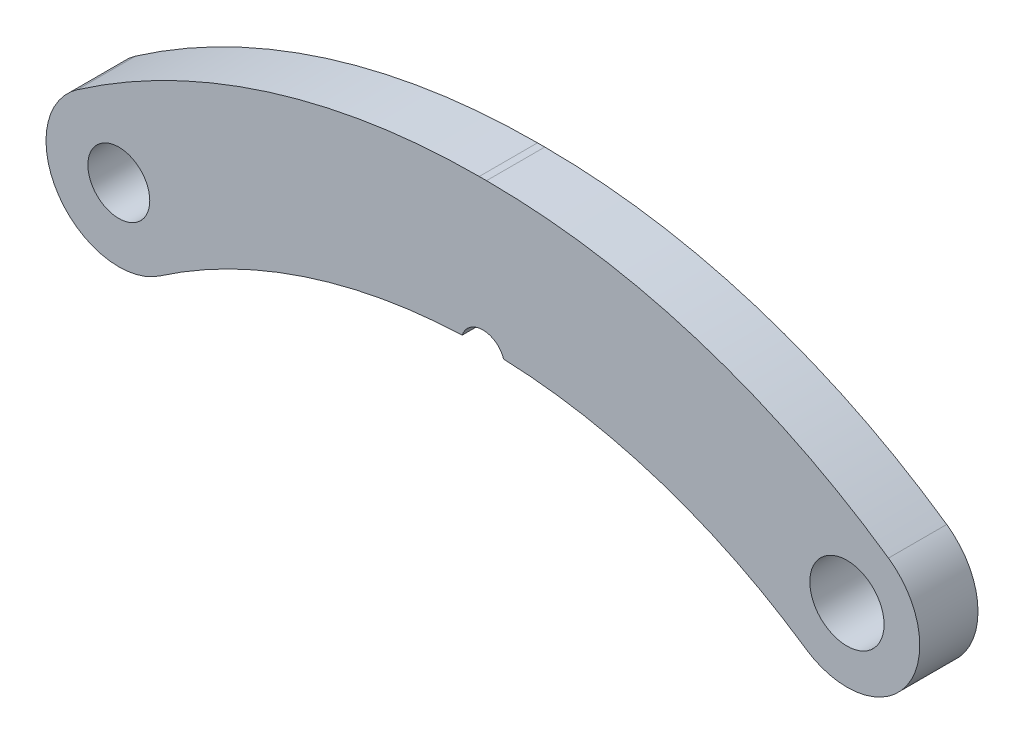
ISO-10303-21;
HEADER;
FILE_DESCRIPTION(('STEP AP214'),'2;1');
FILE_NAME('part.step','',(''),(''),'','','');
FILE_SCHEMA(('AUTOMOTIVE_DESIGN { 1 0 10303 214 1 1 1 1 }'));
ENDSEC;
DATA;
#1=APPLICATION_CONTEXT('core data for automotive mechanical design processes');
#2=APPLICATION_PROTOCOL_DEFINITION('international standard','automotive_design',2000,#1);
#3=PRODUCT_CONTEXT('',#1,'mechanical');
#4=PRODUCT('Part','Part','',(#3));
#5=PRODUCT_RELATED_PRODUCT_CATEGORY('part','',(#4));
#6=PRODUCT_DEFINITION_FORMATION('','',#4);
#7=PRODUCT_DEFINITION_CONTEXT('part definition',#1,'design');
#8=PRODUCT_DEFINITION('design','',#6,#7);
#9=PRODUCT_DEFINITION_SHAPE('','',#8);
#10=(LENGTH_UNIT() NAMED_UNIT(*) SI_UNIT(.MILLI.,.METRE.));
#11=(NAMED_UNIT(*) PLANE_ANGLE_UNIT() SI_UNIT($,.RADIAN.));
#12=(NAMED_UNIT(*) SI_UNIT($,.STERADIAN.) SOLID_ANGLE_UNIT());
#13=UNCERTAINTY_MEASURE_WITH_UNIT(LENGTH_MEASURE(1.E-05),#10,'distance_accuracy_value','');
#14=(GEOMETRIC_REPRESENTATION_CONTEXT(3) GLOBAL_UNCERTAINTY_ASSIGNED_CONTEXT((#13)) GLOBAL_UNIT_ASSIGNED_CONTEXT((#10,
#11,#12)) REPRESENTATION_CONTEXT('',''));
#15=CARTESIAN_POINT('',(0.,0.,0.));
#16=DIRECTION('',(0.,0.,1.));
#17=DIRECTION('',(1.,0.,0.));
#18=AXIS2_PLACEMENT_3D('',#15,#16,#17);
#19=CARTESIAN_POINT('',(-50.,-72.8951612903225,10.));
#20=DIRECTION('',(0.,0.,-1.));
#21=DIRECTION('',(-1.,0.,0.));
#22=AXIS2_PLACEMENT_3D('',#19,#20,#21);
#23=CYLINDRICAL_SURFACE('',#22,78.3951612903225);
#24=DIRECTION('',(0.,0.,-1.));
#25=VECTOR('',#24,1.);
#26=CARTESIAN_POINT('',(-47.1538280934798,5.44831718245282,4.));
#27=LINE('',#26,#25);
#28=CARTESIAN_POINT('',(-47.1538280934798,5.44831718245284,0.));
#29=VERTEX_POINT('',#28);
#30=CARTESIAN_POINT('',(-47.1538280934798,5.44831718245284,8.));
#31=VERTEX_POINT('',#30);
#32=EDGE_CURVE('E12',#29,#31,#27,.F.);
#33=ORIENTED_EDGE('',*,*,#32,.F.);
#34=CARTESIAN_POINT('',(-50.,-72.8951612903225,0.));
#35=DIRECTION('',(0.,0.,-1.));
#36=DIRECTION('',(-1.,0.,0.));
#37=AXIS2_PLACEMENT_3D('',#34,#35,#36);
#38=CIRCLE('',#37,78.3951612903225);
#39=CARTESIAN_POINT('',(-5.65641821001735,-8.24651035489463,0.));
#40=VERTEX_POINT('',#39);
#41=EDGE_CURVE('E117',#40,#29,#38,.F.);
#42=ORIENTED_EDGE('',*,*,#41,.F.);
#43=DIRECTION('',(0.,0.,-1.));
#44=VECTOR('',#43,1.);
#45=CARTESIAN_POINT('',(-5.65641821001735,-8.24651035489463,10.));
#46=LINE('',#45,#44);
#47=CARTESIAN_POINT('',(-5.65641821001735,-8.24651035489463,8.));
#48=VERTEX_POINT('',#47);
#49=EDGE_CURVE('E124',#48,#40,#46,.T.);
#50=ORIENTED_EDGE('',*,*,#49,.F.);
#51=CARTESIAN_POINT('',(-50.,-72.8951612903225,8.));
#52=DIRECTION('',(0.,0.,1.));
#53=DIRECTION('',(1.,0.,0.));
#54=AXIS2_PLACEMENT_3D('',#51,#52,#53);
#55=CIRCLE('',#54,78.3951612903225);
#56=EDGE_CURVE('E128',#31,#48,#55,.F.);
#57=ORIENTED_EDGE('',*,*,#56,.F.);
#58=EDGE_LOOP('',(#33,#42,#50,#57));
#59=FACE_BOUND('',#58,.T.);
#60=ADVANCED_FACE('F39',(#59),#23,.F.);
#61=CARTESIAN_POINT('',(0.,0.,8.));
#62=DIRECTION('',(0.,0.,1.));
#63=DIRECTION('',(1.,0.,0.));
#64=AXIS2_PLACEMENT_3D('',#61,#62,#63);
#65=PLANE('',#64);
#66=CARTESIAN_POINT('',(-50.,4.5,8.));
#67=DIRECTION('',(0.,0.,-1.));
#68=DIRECTION('',(-1.,0.,0.));
#69=AXIS2_PLACEMENT_3D('',#66,#67,#68);
#70=CIRCLE('',#69,3.);
#71=CARTESIAN_POINT('',(-52.8461719065202,5.44831718245284,8.));
#72=VERTEX_POINT('',#71);
#73=EDGE_CURVE('E53',#72,#31,#70,.T.);
#74=ORIENTED_EDGE('',*,*,#73,.T.);
#75=ORIENTED_EDGE('',*,*,#56,.T.);
#76=CARTESIAN_POINT('',(0.,0.,8.));
#77=DIRECTION('',(0.,0.,-1.));
#78=DIRECTION('',(-1.,0.,0.));
#79=AXIS2_PLACEMENT_3D('',#76,#77,#78);
#80=CIRCLE('',#79,10.);
#81=CARTESIAN_POINT('',(5.70340085485969,8.21408660100354,8.));
#82=VERTEX_POINT('',#81);
#83=EDGE_CURVE('E163',#82,#48,#80,.T.);
#84=ORIENTED_EDGE('',*,*,#83,.F.);
#85=CARTESIAN_POINT('',(-49.5,-71.2903225806452,8.));
#86=DIRECTION('',(0.,0.,-1.));
#87=DIRECTION('',(-1.,0.,0.));
#88=AXIS2_PLACEMENT_3D('',#85,#86,#87);
#89=CIRCLE('',#88,96.7903225806452);
#90=CARTESIAN_POINT('',(-49.5,25.5,8.));
#91=VERTEX_POINT('',#90);
#92=EDGE_CURVE('E140',#82,#91,#89,.F.);
#93=ORIENTED_EDGE('',*,*,#92,.T.);
#94=DIRECTION('',(1.,0.,0.));
#95=VECTOR('',#94,1.);
#96=CARTESIAN_POINT('',(-49.5,25.5,8.));
#97=LINE('',#96,#95);
#98=CARTESIAN_POINT('',(-50.5,25.5,8.));
#99=VERTEX_POINT('',#98);
#100=EDGE_CURVE('E146',#99,#91,#97,.T.);
#101=ORIENTED_EDGE('',*,*,#100,.F.);
#102=CARTESIAN_POINT('',(-50.5,-71.2903225806452,8.));
#103=DIRECTION('',(0.,0.,-1.));
#104=DIRECTION('',(-1.,0.,0.));
#105=AXIS2_PLACEMENT_3D('',#102,#103,#104);
#106=CIRCLE('',#105,96.7903225806452);
#107=CARTESIAN_POINT('',(-105.70340085486,8.21408660100354,8.));
#108=VERTEX_POINT('',#107);
#109=EDGE_CURVE('E134',#99,#108,#106,.F.);
#110=ORIENTED_EDGE('',*,*,#109,.T.);
#111=CARTESIAN_POINT('',(-100.,0.,8.));
#112=DIRECTION('',(0.,0.,-1.));
#113=DIRECTION('',(-1.,0.,0.));
#114=AXIS2_PLACEMENT_3D('',#111,#112,#113);
#115=CIRCLE('',#114,10.);
#116=CARTESIAN_POINT('',(-94.3435817899827,-8.24651035489463,8.));
#117=VERTEX_POINT('',#116);
#118=EDGE_CURVE('E159',#117,#108,#115,.T.);
#119=ORIENTED_EDGE('',*,*,#118,.F.);
#120=EDGE_CURVE('E131',#117,#72,#55,.F.);
#121=ORIENTED_EDGE('',*,*,#120,.T.);
#122=EDGE_LOOP('',(#74,#75,#84,#93,#101,#110,#119,#121));
#123=FACE_BOUND('',#122,.T.);
#124=CARTESIAN_POINT('',(-100.,0.,8.));
#125=DIRECTION('',(0.,0.,1.));
#126=DIRECTION('',(1.,0.,0.));
#127=AXIS2_PLACEMENT_3D('',#124,#125,#126);
#128=CIRCLE('',#127,4.25000000000001);
#129=CARTESIAN_POINT('',(-95.75,0.,8.));
#130=VERTEX_POINT('',#129);
#131=EDGE_CURVE('E172',#130,#130,#128,.T.);
#132=ORIENTED_EDGE('',*,*,#131,.F.);
#133=EDGE_LOOP('',(#132));
#134=FACE_BOUND('',#133,.T.);
#135=CARTESIAN_POINT('',(0.,0.,8.));
#136=DIRECTION('',(0.,0.,1.));
#137=DIRECTION('',(1.,0.,0.));
#138=AXIS2_PLACEMENT_3D('',#135,#136,#137);
#139=CIRCLE('',#138,5.1);
#140=CARTESIAN_POINT('',(5.1,0.,8.));
#141=VERTEX_POINT('',#140);
#142=EDGE_CURVE('E109',#141,#141,#139,.T.);
#143=ORIENTED_EDGE('',*,*,#142,.F.);
#144=EDGE_LOOP('',(#143));
#145=FACE_BOUND('',#144,.T.);
#146=ADVANCED_FACE('F201',(#123,#134,#145),#65,.T.);
#147=CARTESIAN_POINT('',(0.,0.,0.));
#148=DIRECTION('',(0.,0.,1.));
#149=DIRECTION('',(1.,0.,0.));
#150=AXIS2_PLACEMENT_3D('',#147,#148,#149);
#151=PLANE('',#150);
#152=CARTESIAN_POINT('',(0.,0.,0.));
#153=DIRECTION('',(0.,0.,1.));
#154=DIRECTION('',(1.,0.,0.));
#155=AXIS2_PLACEMENT_3D('',#152,#153,#154);
#156=CIRCLE('',#155,5.1);
#157=CARTESIAN_POINT('',(5.1,0.,0.));
#158=VERTEX_POINT('',#157);
#159=EDGE_CURVE('E175',#158,#158,#156,.T.);
#160=ORIENTED_EDGE('',*,*,#159,.T.);
#161=EDGE_LOOP('',(#160));
#162=FACE_BOUND('',#161,.T.);
#163=CARTESIAN_POINT('',(-100.,0.,0.));
#164=DIRECTION('',(0.,0.,1.));
#165=DIRECTION('',(1.,0.,0.));
#166=AXIS2_PLACEMENT_3D('',#163,#164,#165);
#167=CIRCLE('',#166,4.25000000000001);
#168=CARTESIAN_POINT('',(-95.75,0.,0.));
#169=VERTEX_POINT('',#168);
#170=EDGE_CURVE('E168',#169,#169,#167,.T.);
#171=ORIENTED_EDGE('',*,*,#170,.T.);
#172=EDGE_LOOP('',(#171));
#173=FACE_BOUND('',#172,.T.);
#174=ORIENTED_EDGE('',*,*,#41,.T.);
#175=CARTESIAN_POINT('',(-50.,4.5,0.));
#176=DIRECTION('',(0.,0.,-1.));
#177=DIRECTION('',(-1.,0.,0.));
#178=AXIS2_PLACEMENT_3D('',#175,#176,#177);
#179=CIRCLE('',#178,3.);
#180=CARTESIAN_POINT('',(-52.8461719065202,5.44831718245284,0.));
#181=VERTEX_POINT('',#180);
#182=EDGE_CURVE('E103',#181,#29,#179,.T.);
#183=ORIENTED_EDGE('',*,*,#182,.F.);
#184=CARTESIAN_POINT('',(-94.3435817899827,-8.24651035489463,0.));
#185=VERTEX_POINT('',#184);
#186=EDGE_CURVE('E114',#181,#185,#38,.F.);
#187=ORIENTED_EDGE('',*,*,#186,.T.);
#188=CARTESIAN_POINT('',(-100.,0.,0.));
#189=DIRECTION('',(0.,0.,-1.));
#190=DIRECTION('',(-1.,0.,0.));
#191=AXIS2_PLACEMENT_3D('',#188,#189,#190);
#192=CIRCLE('',#191,10.);
#193=CARTESIAN_POINT('',(-105.70340085486,8.21408660100354,0.));
#194=VERTEX_POINT('',#193);
#195=EDGE_CURVE('E169',#185,#194,#192,.T.);
#196=ORIENTED_EDGE('',*,*,#195,.T.);
#197=CARTESIAN_POINT('',(-50.5,-71.2903225806452,0.));
#198=DIRECTION('',(0.,0.,-1.));
#199=DIRECTION('',(-1.,0.,0.));
#200=AXIS2_PLACEMENT_3D('',#197,#198,#199);
#201=CIRCLE('',#200,96.7903225806452);
#202=CARTESIAN_POINT('',(-50.5,25.5,0.));
#203=VERTEX_POINT('',#202);
#204=EDGE_CURVE('E133',#203,#194,#201,.F.);
#205=ORIENTED_EDGE('',*,*,#204,.F.);
#206=DIRECTION('',(1.,0.,0.));
#207=VECTOR('',#206,1.);
#208=CARTESIAN_POINT('',(-49.5,25.5,0.));
#209=LINE('',#208,#207);
#210=CARTESIAN_POINT('',(-49.5,25.5,0.));
#211=VERTEX_POINT('',#210);
#212=EDGE_CURVE('E145',#203,#211,#209,.T.);
#213=ORIENTED_EDGE('',*,*,#212,.T.);
#214=CARTESIAN_POINT('',(-49.5,-71.2903225806452,0.));
#215=DIRECTION('',(0.,0.,-1.));
#216=DIRECTION('',(-1.,0.,0.));
#217=AXIS2_PLACEMENT_3D('',#214,#215,#216);
#218=CIRCLE('',#217,96.7903225806452);
#219=CARTESIAN_POINT('',(5.70340085485969,8.21408660100354,0.));
#220=VERTEX_POINT('',#219);
#221=EDGE_CURVE('E61',#220,#211,#218,.F.);
#222=ORIENTED_EDGE('',*,*,#221,.F.);
#223=CARTESIAN_POINT('',(0.,0.,0.));
#224=DIRECTION('',(0.,0.,-1.));
#225=DIRECTION('',(-1.,0.,0.));
#226=AXIS2_PLACEMENT_3D('',#223,#224,#225);
#227=CIRCLE('',#226,10.);
#228=EDGE_CURVE('E164',#220,#40,#227,.T.);
#229=ORIENTED_EDGE('',*,*,#228,.T.);
#230=EDGE_LOOP('',(#174,#183,#187,#196,#205,#213,#222,#229));
#231=FACE_BOUND('',#230,.T.);
#232=ADVANCED_FACE('F112',(#162,#173,#231),#151,.F.);
#233=CARTESIAN_POINT('',(-100.,0.,8.));
#234=DIRECTION('',(0.,0.,-1.));
#235=DIRECTION('',(-1.,0.,0.));
#236=AXIS2_PLACEMENT_3D('',#233,#234,#235);
#237=CYLINDRICAL_SURFACE('',#236,10.);
#238=ORIENTED_EDGE('',*,*,#118,.T.);
#239=DIRECTION('',(0.,0.,-1.));
#240=VECTOR('',#239,1.);
#241=CARTESIAN_POINT('',(-105.70340085486,8.21408660100354,8.));
#242=LINE('',#241,#240);
#243=EDGE_CURVE('E136',#108,#194,#242,.T.);
#244=ORIENTED_EDGE('',*,*,#243,.T.);
#245=ORIENTED_EDGE('',*,*,#195,.F.);
#246=DIRECTION('',(0.,0.,-1.));
#247=VECTOR('',#246,1.);
#248=CARTESIAN_POINT('',(-94.3435817899827,-8.24651035489463,10.));
#249=LINE('',#248,#247);
#250=EDGE_CURVE('E122',#117,#185,#249,.T.);
#251=ORIENTED_EDGE('',*,*,#250,.F.);
#252=EDGE_LOOP('',(#238,#244,#245,#251));
#253=FACE_BOUND('',#252,.T.);
#254=ADVANCED_FACE('F197',(#253),#237,.T.);
#255=CARTESIAN_POINT('',(-100.,0.,8.));
#256=DIRECTION('',(0.,0.,-1.));
#257=DIRECTION('',(-1.,0.,0.));
#258=AXIS2_PLACEMENT_3D('',#255,#256,#257);
#259=CYLINDRICAL_SURFACE('',#258,4.25000000000001);
#260=ORIENTED_EDGE('',*,*,#131,.T.);
#261=EDGE_LOOP('',(#260));
#262=FACE_BOUND('',#261,.T.);
#263=ORIENTED_EDGE('',*,*,#170,.F.);
#264=EDGE_LOOP('',(#263));
#265=FACE_BOUND('',#264,.T.);
#266=ADVANCED_FACE('F41',(#262,#265),#259,.F.);
#267=CARTESIAN_POINT('',(0.,0.,8.));
#268=DIRECTION('',(0.,0.,-1.));
#269=DIRECTION('',(-1.,0.,0.));
#270=AXIS2_PLACEMENT_3D('',#267,#268,#269);
#271=CYLINDRICAL_SURFACE('',#270,5.1);
#272=ORIENTED_EDGE('',*,*,#142,.T.);
#273=EDGE_LOOP('',(#272));
#274=FACE_BOUND('',#273,.T.);
#275=ORIENTED_EDGE('',*,*,#159,.F.);
#276=EDGE_LOOP('',(#275));
#277=FACE_BOUND('',#276,.T.);
#278=ADVANCED_FACE('F186',(#274,#277),#271,.F.);
#279=CARTESIAN_POINT('',(0.,0.,8.));
#280=DIRECTION('',(0.,0.,-1.));
#281=DIRECTION('',(-1.,0.,0.));
#282=AXIS2_PLACEMENT_3D('',#279,#280,#281);
#283=CYLINDRICAL_SURFACE('',#282,10.);
#284=DIRECTION('',(0.,0.,-1.));
#285=VECTOR('',#284,1.);
#286=CARTESIAN_POINT('',(5.70340085485969,8.21408660100354,8.));
#287=LINE('',#286,#285);
#288=EDGE_CURVE('E142',#82,#220,#287,.T.);
#289=ORIENTED_EDGE('',*,*,#288,.F.);
#290=ORIENTED_EDGE('',*,*,#83,.T.);
#291=ORIENTED_EDGE('',*,*,#49,.T.);
#292=ORIENTED_EDGE('',*,*,#228,.F.);
#293=EDGE_LOOP('',(#289,#290,#291,#292));
#294=FACE_BOUND('',#293,.T.);
#295=ADVANCED_FACE('F188',(#294),#283,.T.);
#296=CARTESIAN_POINT('',(-49.5,25.5,8.));
#297=DIRECTION('',(0.,1.,0.));
#298=DIRECTION('',(0.,0.,1.));
#299=AXIS2_PLACEMENT_3D('',#296,#297,#298);
#300=PLANE('',#299);
#301=ORIENTED_EDGE('',*,*,#212,.F.);
#302=DIRECTION('',(0.,0.,-1.));
#303=VECTOR('',#302,1.);
#304=CARTESIAN_POINT('',(-50.5,25.5,8.));
#305=LINE('',#304,#303);
#306=EDGE_CURVE('E150',#99,#203,#305,.T.);
#307=ORIENTED_EDGE('',*,*,#306,.F.);
#308=ORIENTED_EDGE('',*,*,#100,.T.);
#309=DIRECTION('',(0.,0.,-1.));
#310=VECTOR('',#309,1.);
#311=CARTESIAN_POINT('',(-49.5,25.5,8.));
#312=LINE('',#311,#310);
#313=EDGE_CURVE('E171',#91,#211,#312,.T.);
#314=ORIENTED_EDGE('',*,*,#313,.T.);
#315=EDGE_LOOP('',(#301,#307,#308,#314));
#316=FACE_BOUND('',#315,.T.);
#317=ADVANCED_FACE('F194',(#316),#300,.T.);
#318=CARTESIAN_POINT('',(-49.5,-71.2903225806452,8.));
#319=DIRECTION('',(0.,0.,-1.));
#320=DIRECTION('',(-1.,0.,0.));
#321=AXIS2_PLACEMENT_3D('',#318,#319,#320);
#322=CYLINDRICAL_SURFACE('',#321,96.7903225806452);
#323=ORIENTED_EDGE('',*,*,#221,.T.);
#324=ORIENTED_EDGE('',*,*,#313,.F.);
#325=ORIENTED_EDGE('',*,*,#92,.F.);
#326=ORIENTED_EDGE('',*,*,#288,.T.);
#327=EDGE_LOOP('',(#323,#324,#325,#326));
#328=FACE_BOUND('',#327,.T.);
#329=ADVANCED_FACE('F217',(#328),#322,.T.);
#330=CARTESIAN_POINT('',(-50.5,-71.2903225806452,8.));
#331=DIRECTION('',(0.,0.,-1.));
#332=DIRECTION('',(-1.,0.,0.));
#333=AXIS2_PLACEMENT_3D('',#330,#331,#332);
#334=CYLINDRICAL_SURFACE('',#333,96.7903225806452);
#335=ORIENTED_EDGE('',*,*,#204,.T.);
#336=ORIENTED_EDGE('',*,*,#243,.F.);
#337=ORIENTED_EDGE('',*,*,#109,.F.);
#338=ORIENTED_EDGE('',*,*,#306,.T.);
#339=EDGE_LOOP('',(#335,#336,#337,#338));
#340=FACE_BOUND('',#339,.T.);
#341=ADVANCED_FACE('F212',(#340),#334,.T.);
#342=DIRECTION('',(0.,0.,-1.));
#343=VECTOR('',#342,1.);
#344=CARTESIAN_POINT('',(-52.8461719065202,5.44831718245282,4.));
#345=LINE('',#344,#343);
#346=EDGE_CURVE('E47',#72,#181,#345,.T.);
#347=ORIENTED_EDGE('',*,*,#346,.F.);
#348=ORIENTED_EDGE('',*,*,#120,.F.);
#349=ORIENTED_EDGE('',*,*,#250,.T.);
#350=ORIENTED_EDGE('',*,*,#186,.F.);
#351=EDGE_LOOP('',(#347,#348,#349,#350));
#352=FACE_BOUND('',#351,.T.);
#353=ADVANCED_FACE('F120',(#352),#23,.F.);
#354=CARTESIAN_POINT('',(-50.,4.5,8.));
#355=DIRECTION('',(0.,0.,-1.));
#356=DIRECTION('',(-1.,0.,0.));
#357=AXIS2_PLACEMENT_3D('',#354,#355,#356);
#358=CYLINDRICAL_SURFACE('',#357,3.);
#359=ORIENTED_EDGE('',*,*,#32,.T.);
#360=ORIENTED_EDGE('',*,*,#73,.F.);
#361=ORIENTED_EDGE('',*,*,#346,.T.);
#362=ORIENTED_EDGE('',*,*,#182,.T.);
#363=EDGE_LOOP('',(#359,#360,#361,#362));
#364=FACE_BOUND('',#363,.T.);
#365=ADVANCED_FACE('F102',(#364),#358,.F.);
#366=CLOSED_SHELL('',(#60,#146,#232,#254,#266,#278,#295,#317,#329,#341,#353,#365));
#367=MANIFOLD_SOLID_BREP('B2',#366);
#368=ADVANCED_BREP_SHAPE_REPRESENTATION('',(#18,#367),#14);
#369=SHAPE_DEFINITION_REPRESENTATION(#9,#368);
ENDSEC;
END-ISO-10303-21;
